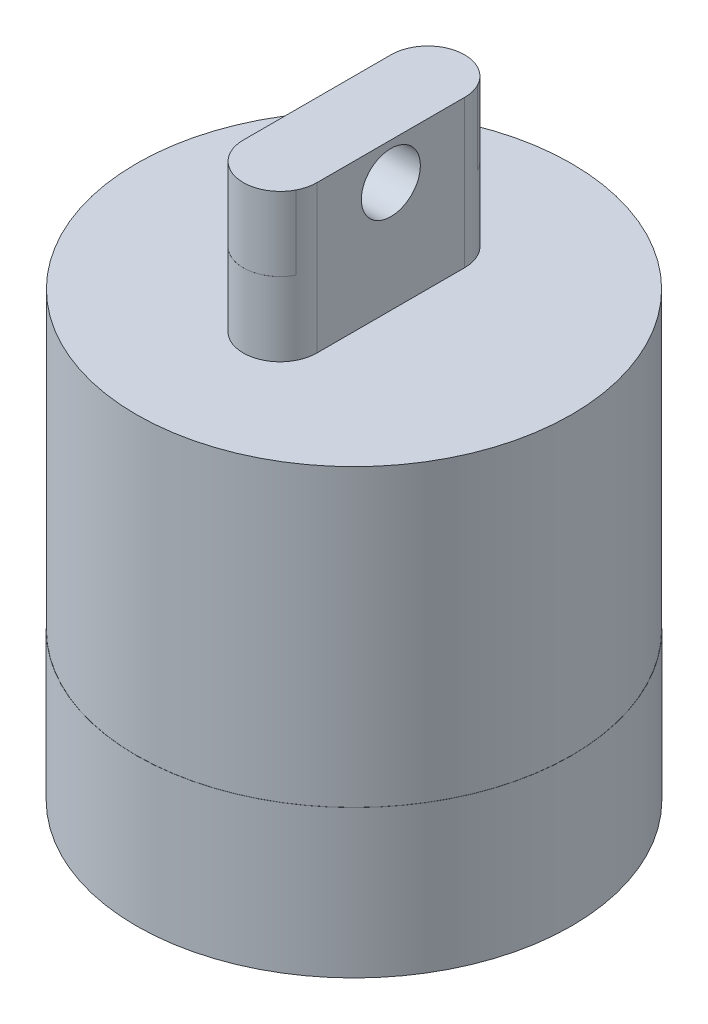
ISO-10303-21;
HEADER;
FILE_DESCRIPTION(('STEP AP214'),'2;1');
FILE_NAME('part.step','',(''),(''),'','','');
FILE_SCHEMA(('AUTOMOTIVE_DESIGN { 1 0 10303 214 1 1 1 1 }'));
ENDSEC;
DATA;
#1=APPLICATION_CONTEXT('core data for automotive mechanical design processes');
#2=APPLICATION_PROTOCOL_DEFINITION('international standard','automotive_design',2000,#1);
#3=PRODUCT_CONTEXT('',#1,'mechanical');
#4=PRODUCT('Part','Part','',(#3));
#5=PRODUCT_RELATED_PRODUCT_CATEGORY('part','',(#4));
#6=PRODUCT_DEFINITION_FORMATION('','',#4);
#7=PRODUCT_DEFINITION_CONTEXT('part definition',#1,'design');
#8=PRODUCT_DEFINITION('design','',#6,#7);
#9=PRODUCT_DEFINITION_SHAPE('','',#8);
#10=(LENGTH_UNIT() NAMED_UNIT(*) SI_UNIT(.MILLI.,.METRE.));
#11=(NAMED_UNIT(*) PLANE_ANGLE_UNIT() SI_UNIT($,.RADIAN.));
#12=(NAMED_UNIT(*) SI_UNIT($,.STERADIAN.) SOLID_ANGLE_UNIT());
#13=UNCERTAINTY_MEASURE_WITH_UNIT(LENGTH_MEASURE(1.E-05),#10,'distance_accuracy_value','');
#14=(GEOMETRIC_REPRESENTATION_CONTEXT(3) GLOBAL_UNCERTAINTY_ASSIGNED_CONTEXT((#13)) GLOBAL_UNIT_ASSIGNED_CONTEXT((#10,
#11,#12)) REPRESENTATION_CONTEXT('',''));
#15=CARTESIAN_POINT('',(0.,0.,0.));
#16=DIRECTION('',(0.,0.,1.));
#17=DIRECTION('',(1.,0.,0.));
#18=AXIS2_PLACEMENT_3D('',#15,#16,#17);
#19=CARTESIAN_POINT('',(0.,76.2,0.));
#20=DIRECTION('',(0.,-1.,0.));
#21=DIRECTION('',(0.,0.,-1.));
#22=AXIS2_PLACEMENT_3D('',#19,#20,#21);
#23=CYLINDRICAL_SURFACE('',#22,37.4396440225819);
#24=CARTESIAN_POINT('',(0.,0.,0.));
#25=DIRECTION('',(0.,1.,0.));
#26=DIRECTION('',(0.,0.,1.));
#27=AXIS2_PLACEMENT_3D('',#24,#25,#26);
#28=CIRCLE('',#27,37.4396440225819);
#29=CARTESIAN_POINT('',(0.,0.,37.4396440225819));
#30=VERTEX_POINT('',#29);
#31=EDGE_CURVE('E182',#30,#30,#28,.F.);
#32=ORIENTED_EDGE('',*,*,#31,.F.);
#33=EDGE_LOOP('',(#32));
#34=FACE_BOUND('',#33,.T.);
#35=CARTESIAN_POINT('',(0.,50.8,0.));
#36=DIRECTION('',(0.,1.,0.));
#37=DIRECTION('',(0.,0.,1.));
#38=AXIS2_PLACEMENT_3D('',#35,#36,#37);
#39=CIRCLE('',#38,37.4396440225819);
#40=CARTESIAN_POINT('',(0.,50.8,37.4396440225819));
#41=VERTEX_POINT('',#40);
#42=EDGE_CURVE('E157',#41,#41,#39,.T.);
#43=ORIENTED_EDGE('',*,*,#42,.F.);
#44=EDGE_LOOP('',(#43));
#45=FACE_BOUND('',#44,.T.);
#46=ADVANCED_FACE('F39',(#34,#45),#23,.T.);
#47=CARTESIAN_POINT('',(0.,50.8,12.7181992153051));
#48=DIRECTION('',(0.,1.,0.));
#49=DIRECTION('',(0.,0.,1.));
#50=AXIS2_PLACEMENT_3D('',#47,#48,#49);
#51=CYLINDRICAL_SURFACE('',#50,6.34167741694654);
#52=DIRECTION('',(0.,1.,0.));
#53=VECTOR('',#52,1.);
#54=CARTESIAN_POINT('',(-5.64341315538932,63.5,15.6110802045939));
#55=LINE('',#54,#53);
#56=CARTESIAN_POINT('',(-5.64341315538932,63.5,15.6110802045939));
#57=VERTEX_POINT('',#56);
#58=CARTESIAN_POINT('',(-5.64341315538932,76.2,15.6110802045939));
#59=VERTEX_POINT('',#58);
#60=EDGE_CURVE('E179',#57,#59,#55,.T.);
#61=ORIENTED_EDGE('',*,*,#60,.T.);
#62=CARTESIAN_POINT('',(0.,76.2,12.7181992153051));
#63=DIRECTION('',(0.,1.,0.));
#64=DIRECTION('',(0.,0.,1.));
#65=AXIS2_PLACEMENT_3D('',#62,#63,#64);
#66=CIRCLE('',#65,6.34167741694654);
#67=CARTESIAN_POINT('',(-6.34167741694654,76.2,12.7181992153051));
#68=VERTEX_POINT('',#67);
#69=EDGE_CURVE('E146',#68,#59,#66,.T.);
#70=ORIENTED_EDGE('',*,*,#69,.F.);
#71=DIRECTION('',(0.,1.,0.));
#72=VECTOR('',#71,1.);
#73=CARTESIAN_POINT('',(-6.34167741694654,50.8,12.7181992153051));
#74=LINE('',#73,#72);
#75=CARTESIAN_POINT('',(-6.34167741694654,50.8,12.7181992153051));
#76=VERTEX_POINT('',#75);
#77=EDGE_CURVE('E131',#76,#68,#74,.T.);
#78=ORIENTED_EDGE('',*,*,#77,.F.);
#79=CARTESIAN_POINT('',(0.,50.8,12.7181992153051));
#80=DIRECTION('',(0.,1.,0.));
#81=DIRECTION('',(0.,0.,1.));
#82=AXIS2_PLACEMENT_3D('',#79,#80,#81);
#83=CIRCLE('',#82,6.34167741694654);
#84=CARTESIAN_POINT('',(6.34167741694654,50.8,12.7181992153051));
#85=VERTEX_POINT('',#84);
#86=EDGE_CURVE('E123',#76,#85,#83,.T.);
#87=ORIENTED_EDGE('',*,*,#86,.T.);
#88=DIRECTION('',(0.,1.,0.));
#89=VECTOR('',#88,1.);
#90=CARTESIAN_POINT('',(6.34167741694654,50.8,12.7181992153051));
#91=LINE('',#90,#89);
#92=CARTESIAN_POINT('',(6.34167741694654,76.2,12.7181992153051));
#93=VERTEX_POINT('',#92);
#94=EDGE_CURVE('E106',#85,#93,#91,.T.);
#95=ORIENTED_EDGE('',*,*,#94,.T.);
#96=CARTESIAN_POINT('',(0.,76.2,12.7181992153051));
#97=DIRECTION('',(0.,1.,0.));
#98=DIRECTION('',(0.,0.,1.));
#99=AXIS2_PLACEMENT_3D('',#96,#97,#98);
#100=CIRCLE('',#99,6.34167741694654);
#101=CARTESIAN_POINT('',(5.64341315538739,76.2,15.6110802045977));
#102=VERTEX_POINT('',#101);
#103=EDGE_CURVE('E43',#102,#93,#100,.T.);
#104=ORIENTED_EDGE('',*,*,#103,.F.);
#105=DIRECTION('',(0.,1.,0.));
#106=VECTOR('',#105,1.);
#107=CARTESIAN_POINT('',(5.64341315538739,63.5,15.6110802045977));
#108=LINE('',#107,#106);
#109=CARTESIAN_POINT('',(5.64341315538739,63.5,15.6110802045977));
#110=VERTEX_POINT('',#109);
#111=EDGE_CURVE('E174',#102,#110,#108,.F.);
#112=ORIENTED_EDGE('',*,*,#111,.T.);
#113=CARTESIAN_POINT('',(0.,63.5,12.7181992153051));
#114=DIRECTION('',(0.,1.,0.));
#115=DIRECTION('',(0.,0.,1.));
#116=AXIS2_PLACEMENT_3D('',#113,#114,#115);
#117=CIRCLE('',#116,6.34167741694654);
#118=EDGE_CURVE('E63',#57,#110,#117,.T.);
#119=ORIENTED_EDGE('',*,*,#118,.F.);
#120=EDGE_LOOP('',(#61,#70,#78,#87,#95,#104,#112,#119));
#121=FACE_BOUND('',#120,.T.);
#122=ADVANCED_FACE('F129',(#121),#51,.T.);
#123=CARTESIAN_POINT('',(0.,50.8,-12.7181992153051));
#124=DIRECTION('',(0.,1.,0.));
#125=DIRECTION('',(0.,0.,1.));
#126=AXIS2_PLACEMENT_3D('',#123,#124,#125);
#127=CYLINDRICAL_SURFACE('',#126,6.34167741694654);
#128=DIRECTION('',(0.,1.,0.));
#129=VECTOR('',#128,1.);
#130=CARTESIAN_POINT('',(5.64341315538851,63.5,-15.6110802045955));
#131=LINE('',#130,#129);
#132=CARTESIAN_POINT('',(5.64341315538851,63.5,-15.6110802045955));
#133=VERTEX_POINT('',#132);
#134=CARTESIAN_POINT('',(5.64341315538851,76.2,-15.6110802045955));
#135=VERTEX_POINT('',#134);
#136=EDGE_CURVE('E171',#133,#135,#131,.T.);
#137=ORIENTED_EDGE('',*,*,#136,.T.);
#138=CARTESIAN_POINT('',(0.,76.2,-12.7181992153051));
#139=DIRECTION('',(0.,1.,0.));
#140=DIRECTION('',(0.,0.,1.));
#141=AXIS2_PLACEMENT_3D('',#138,#139,#140);
#142=CIRCLE('',#141,6.34167741694654);
#143=CARTESIAN_POINT('',(6.34167741694654,76.2,-12.7181992153051));
#144=VERTEX_POINT('',#143);
#145=EDGE_CURVE('E55',#144,#135,#142,.T.);
#146=ORIENTED_EDGE('',*,*,#145,.F.);
#147=DIRECTION('',(0.,1.,0.));
#148=VECTOR('',#147,1.);
#149=CARTESIAN_POINT('',(6.34167741694654,50.8,-12.7181992153051));
#150=LINE('',#149,#148);
#151=CARTESIAN_POINT('',(6.34167741694654,50.8,-12.7181992153051));
#152=VERTEX_POINT('',#151);
#153=EDGE_CURVE('E115',#152,#144,#150,.T.);
#154=ORIENTED_EDGE('',*,*,#153,.F.);
#155=CARTESIAN_POINT('',(0.,50.8,-12.7181992153051));
#156=DIRECTION('',(0.,1.,0.));
#157=DIRECTION('',(0.,0.,1.));
#158=AXIS2_PLACEMENT_3D('',#155,#156,#157);
#159=CIRCLE('',#158,6.34167741694654);
#160=CARTESIAN_POINT('',(-6.34167741694654,50.8,-12.7181992153051));
#161=VERTEX_POINT('',#160);
#162=EDGE_CURVE('E126',#152,#161,#159,.T.);
#163=ORIENTED_EDGE('',*,*,#162,.T.);
#164=DIRECTION('',(0.,1.,0.));
#165=VECTOR('',#164,1.);
#166=CARTESIAN_POINT('',(-6.34167741694654,50.8,-12.7181992153051));
#167=LINE('',#166,#165);
#168=CARTESIAN_POINT('',(-6.34167741694654,76.2,-12.7181992153051));
#169=VERTEX_POINT('',#168);
#170=EDGE_CURVE('E158',#161,#169,#167,.T.);
#171=ORIENTED_EDGE('',*,*,#170,.T.);
#172=CARTESIAN_POINT('',(0.,76.2,-12.7181992153051));
#173=DIRECTION('',(0.,1.,0.));
#174=DIRECTION('',(0.,0.,1.));
#175=AXIS2_PLACEMENT_3D('',#172,#173,#174);
#176=CIRCLE('',#175,6.34167741694654);
#177=CARTESIAN_POINT('',(-5.64341315538945,76.2,-15.6110802045937));
#178=VERTEX_POINT('',#177);
#179=EDGE_CURVE('E11',#178,#169,#176,.T.);
#180=ORIENTED_EDGE('',*,*,#179,.F.);
#181=DIRECTION('',(0.,1.,0.));
#182=VECTOR('',#181,1.);
#183=CARTESIAN_POINT('',(-5.64341315538945,63.5,-15.6110802045937));
#184=LINE('',#183,#182);
#185=CARTESIAN_POINT('',(-5.64341315538945,63.5,-15.6110802045937));
#186=VERTEX_POINT('',#185);
#187=EDGE_CURVE('E163',#178,#186,#184,.F.);
#188=ORIENTED_EDGE('',*,*,#187,.T.);
#189=CARTESIAN_POINT('',(0.,63.5,-12.7181992153051));
#190=DIRECTION('',(0.,1.,0.));
#191=DIRECTION('',(0.,0.,1.));
#192=AXIS2_PLACEMENT_3D('',#189,#190,#191);
#193=CIRCLE('',#192,6.34167741694654);
#194=EDGE_CURVE('E166',#133,#186,#193,.T.);
#195=ORIENTED_EDGE('',*,*,#194,.F.);
#196=EDGE_LOOP('',(#137,#146,#154,#163,#171,#180,#188,#195));
#197=FACE_BOUND('',#196,.T.);
#198=ADVANCED_FACE('F224',(#197),#127,.T.);
#199=CARTESIAN_POINT('',(0.,50.8,0.));
#200=DIRECTION('',(0.,1.,0.));
#201=DIRECTION('',(0.,0.,1.));
#202=AXIS2_PLACEMENT_3D('',#199,#200,#201);
#203=PLANE('',#202);
#204=DIRECTION('',(0.,0.,1.));
#205=VECTOR('',#204,1.);
#206=CARTESIAN_POINT('',(-6.34167741694654,50.8,12.7181992153051));
#207=LINE('',#206,#205);
#208=EDGE_CURVE('E116',#161,#76,#207,.T.);
#209=ORIENTED_EDGE('',*,*,#208,.F.);
#210=ORIENTED_EDGE('',*,*,#162,.F.);
#211=DIRECTION('',(0.,0.,-1.));
#212=VECTOR('',#211,1.);
#213=CARTESIAN_POINT('',(6.34167741694654,50.8,12.7181992153051));
#214=LINE('',#213,#212);
#215=EDGE_CURVE('E109',#85,#152,#214,.T.);
#216=ORIENTED_EDGE('',*,*,#215,.F.);
#217=ORIENTED_EDGE('',*,*,#86,.F.);
#218=EDGE_LOOP('',(#209,#210,#216,#217));
#219=FACE_BOUND('',#218,.T.);
#220=ORIENTED_EDGE('',*,*,#42,.T.);
#221=EDGE_LOOP('',(#220));
#222=FACE_BOUND('',#221,.T.);
#223=ADVANCED_FACE('F121',(#219,#222),#203,.T.);
#224=CARTESIAN_POINT('',(-6.34167741694654,50.8,12.7181992153051));
#225=DIRECTION('',(-1.,0.,0.));
#226=DIRECTION('',(0.,0.,1.));
#227=AXIS2_PLACEMENT_3D('',#224,#225,#226);
#228=PLANE('',#227);
#229=CARTESIAN_POINT('',(-6.34167741694654,69.85,0.));
#230=DIRECTION('',(-1.,0.,0.));
#231=DIRECTION('',(0.,0.,1.));
#232=AXIS2_PLACEMENT_3D('',#229,#230,#231);
#233=CIRCLE('',#232,5.08);
#234=CARTESIAN_POINT('',(-6.34167741694654,69.85,5.08));
#235=VERTEX_POINT('',#234);
#236=EDGE_CURVE('E167',#235,#235,#233,.T.);
#237=ORIENTED_EDGE('',*,*,#236,.F.);
#238=EDGE_LOOP('',(#237));
#239=FACE_BOUND('',#238,.T.);
#240=DIRECTION('',(0.,0.,1.));
#241=VECTOR('',#240,1.);
#242=CARTESIAN_POINT('',(-6.34167741694654,76.2,12.7181992153051));
#243=LINE('',#242,#241);
#244=EDGE_CURVE('E133',#169,#68,#243,.T.);
#245=ORIENTED_EDGE('',*,*,#244,.F.);
#246=ORIENTED_EDGE('',*,*,#170,.F.);
#247=ORIENTED_EDGE('',*,*,#208,.T.);
#248=ORIENTED_EDGE('',*,*,#77,.T.);
#249=EDGE_LOOP('',(#245,#246,#247,#248));
#250=FACE_BOUND('',#249,.T.);
#251=ADVANCED_FACE('F215',(#239,#250),#228,.T.);
#252=CARTESIAN_POINT('',(6.34167741694654,50.8,12.7181992153051));
#253=DIRECTION('',(1.,0.,0.));
#254=DIRECTION('',(0.,0.,-1.));
#255=AXIS2_PLACEMENT_3D('',#252,#253,#254);
#256=PLANE('',#255);
#257=CARTESIAN_POINT('',(6.34167741694654,69.85,0.));
#258=DIRECTION('',(1.,0.,0.));
#259=DIRECTION('',(0.,0.,-1.));
#260=AXIS2_PLACEMENT_3D('',#257,#258,#259);
#261=CIRCLE('',#260,5.08);
#262=CARTESIAN_POINT('',(6.34167741694654,69.85,-5.08));
#263=VERTEX_POINT('',#262);
#264=EDGE_CURVE('E205',#263,#263,#261,.T.);
#265=ORIENTED_EDGE('',*,*,#264,.F.);
#266=EDGE_LOOP('',(#265));
#267=FACE_BOUND('',#266,.T.);
#268=DIRECTION('',(0.,0.,-1.));
#269=VECTOR('',#268,1.);
#270=CARTESIAN_POINT('',(6.34167741694654,76.2,12.7181992153051));
#271=LINE('',#270,#269);
#272=EDGE_CURVE('E111',#93,#144,#271,.T.);
#273=ORIENTED_EDGE('',*,*,#272,.F.);
#274=ORIENTED_EDGE('',*,*,#94,.F.);
#275=ORIENTED_EDGE('',*,*,#215,.T.);
#276=ORIENTED_EDGE('',*,*,#153,.T.);
#277=EDGE_LOOP('',(#273,#274,#275,#276));
#278=FACE_BOUND('',#277,.T.);
#279=ADVANCED_FACE('F108',(#267,#278),#256,.T.);
#280=CARTESIAN_POINT('',(76.2,69.85,0.));
#281=DIRECTION('',(-1.,0.,0.));
#282=DIRECTION('',(0.,0.,1.));
#283=AXIS2_PLACEMENT_3D('',#280,#281,#282);
#284=CYLINDRICAL_SURFACE('',#283,5.08);
#285=ORIENTED_EDGE('',*,*,#264,.T.);
#286=EDGE_LOOP('',(#285));
#287=FACE_BOUND('',#286,.T.);
#288=ORIENTED_EDGE('',*,*,#236,.T.);
#289=EDGE_LOOP('',(#288));
#290=FACE_BOUND('',#289,.T.);
#291=ADVANCED_FACE('F213',(#287,#290),#284,.F.);
#292=CARTESIAN_POINT('',(0.,63.5,0.));
#293=DIRECTION('',(0.,1.,0.));
#294=DIRECTION('',(0.,0.,1.));
#295=AXIS2_PLACEMENT_3D('',#292,#293,#294);
#296=PLANE('',#295);
#297=CARTESIAN_POINT('',(0.,63.5,12.7));
#298=DIRECTION('',(0.,1.,0.));
#299=DIRECTION('',(0.,0.,1.));
#300=AXIS2_PLACEMENT_3D('',#297,#298,#299);
#301=CIRCLE('',#300,6.35);
#302=EDGE_CURVE('E195',#110,#57,#301,.F.);
#303=ORIENTED_EDGE('',*,*,#302,.T.);
#304=ORIENTED_EDGE('',*,*,#118,.T.);
#305=EDGE_LOOP('',(#303,#304));
#306=FACE_BOUND('',#305,.T.);
#307=ADVANCED_FACE('F41',(#306),#296,.T.);
#308=CARTESIAN_POINT('',(0.,63.5,-12.7));
#309=DIRECTION('',(0.,1.,0.));
#310=DIRECTION('',(0.,0.,1.));
#311=AXIS2_PLACEMENT_3D('',#308,#309,#310);
#312=CIRCLE('',#311,6.35);
#313=EDGE_CURVE('E191',#186,#133,#312,.F.);
#314=ORIENTED_EDGE('',*,*,#313,.T.);
#315=ORIENTED_EDGE('',*,*,#194,.T.);
#316=EDGE_LOOP('',(#314,#315));
#317=FACE_BOUND('',#316,.T.);
#318=ADVANCED_FACE('F230',(#317),#296,.T.);
#319=CARTESIAN_POINT('',(0.,76.2,12.7));
#320=DIRECTION('',(0.,-1.,0.));
#321=DIRECTION('',(0.,0.,-1.));
#322=AXIS2_PLACEMENT_3D('',#319,#320,#321);
#323=CYLINDRICAL_SURFACE('',#322,6.35);
#324=ORIENTED_EDGE('',*,*,#60,.F.);
#325=ORIENTED_EDGE('',*,*,#302,.F.);
#326=ORIENTED_EDGE('',*,*,#111,.F.);
#327=CARTESIAN_POINT('',(0.,76.2,12.7));
#328=DIRECTION('',(0.,1.,0.));
#329=DIRECTION('',(0.,0.,1.));
#330=AXIS2_PLACEMENT_3D('',#327,#328,#329);
#331=CIRCLE('',#330,6.35);
#332=EDGE_CURVE('E183',#59,#102,#331,.T.);
#333=ORIENTED_EDGE('',*,*,#332,.F.);
#334=EDGE_LOOP('',(#324,#325,#326,#333));
#335=FACE_BOUND('',#334,.T.);
#336=ADVANCED_FACE('F236',(#335),#323,.T.);
#337=CARTESIAN_POINT('',(0.,76.2,-12.7));
#338=DIRECTION('',(0.,-1.,0.));
#339=DIRECTION('',(0.,0.,-1.));
#340=AXIS2_PLACEMENT_3D('',#337,#338,#339);
#341=CYLINDRICAL_SURFACE('',#340,6.35);
#342=ORIENTED_EDGE('',*,*,#136,.F.);
#343=ORIENTED_EDGE('',*,*,#313,.F.);
#344=ORIENTED_EDGE('',*,*,#187,.F.);
#345=CARTESIAN_POINT('',(0.,76.2,-12.7));
#346=DIRECTION('',(0.,1.,0.));
#347=DIRECTION('',(0.,0.,1.));
#348=AXIS2_PLACEMENT_3D('',#345,#346,#347);
#349=CIRCLE('',#348,6.35);
#350=EDGE_CURVE('E187',#135,#178,#349,.T.);
#351=ORIENTED_EDGE('',*,*,#350,.F.);
#352=EDGE_LOOP('',(#342,#343,#344,#351));
#353=FACE_BOUND('',#352,.T.);
#354=ADVANCED_FACE('F228',(#353),#341,.T.);
#355=CARTESIAN_POINT('',(0.,76.2,12.7));
#356=DIRECTION('',(0.,1.,0.));
#357=DIRECTION('',(0.,0.,1.));
#358=AXIS2_PLACEMENT_3D('',#355,#356,#357);
#359=PLANE('',#358);
#360=ORIENTED_EDGE('',*,*,#244,.T.);
#361=ORIENTED_EDGE('',*,*,#69,.T.);
#362=ORIENTED_EDGE('',*,*,#332,.T.);
#363=ORIENTED_EDGE('',*,*,#103,.T.);
#364=ORIENTED_EDGE('',*,*,#272,.T.);
#365=ORIENTED_EDGE('',*,*,#145,.T.);
#366=ORIENTED_EDGE('',*,*,#350,.T.);
#367=ORIENTED_EDGE('',*,*,#179,.T.);
#368=EDGE_LOOP('',(#360,#361,#362,#363,#364,#365,#366,#367));
#369=FACE_BOUND('',#368,.T.);
#370=ADVANCED_FACE('F221',(#369),#359,.T.);
#371=CARTESIAN_POINT('',(0.,-25.4,0.));
#372=DIRECTION('',(0.,1.,0.));
#373=DIRECTION('',(0.,0.,1.));
#374=AXIS2_PLACEMENT_3D('',#371,#372,#373);
#375=CYLINDRICAL_SURFACE('',#374,37.465);
#376=CARTESIAN_POINT('',(0.,-25.4,0.));
#377=DIRECTION('',(0.,-1.,0.));
#378=DIRECTION('',(0.,0.,-1.));
#379=AXIS2_PLACEMENT_3D('',#376,#377,#378);
#380=CIRCLE('',#379,37.465);
#381=CARTESIAN_POINT('',(0.,-25.4,-37.465));
#382=VERTEX_POINT('',#381);
#383=EDGE_CURVE('E150',#382,#382,#380,.T.);
#384=ORIENTED_EDGE('',*,*,#383,.F.);
#385=EDGE_LOOP('',(#384));
#386=FACE_BOUND('',#385,.T.);
#387=CARTESIAN_POINT('',(0.,0.,0.));
#388=DIRECTION('',(0.,-1.,0.));
#389=DIRECTION('',(0.,0.,-1.));
#390=AXIS2_PLACEMENT_3D('',#387,#388,#389);
#391=CIRCLE('',#390,37.465);
#392=CARTESIAN_POINT('',(0.,0.,-37.465));
#393=VERTEX_POINT('',#392);
#394=EDGE_CURVE('E139',#393,#393,#391,.T.);
#395=ORIENTED_EDGE('',*,*,#394,.T.);
#396=EDGE_LOOP('',(#395));
#397=FACE_BOUND('',#396,.T.);
#398=ADVANCED_FACE('F258',(#386,#397),#375,.T.);
#399=CARTESIAN_POINT('',(0.,-25.4,0.));
#400=DIRECTION('',(0.,-1.,0.));
#401=DIRECTION('',(0.,0.,-1.));
#402=AXIS2_PLACEMENT_3D('',#399,#400,#401);
#403=PLANE('',#402);
#404=ORIENTED_EDGE('',*,*,#383,.T.);
#405=EDGE_LOOP('',(#404));
#406=FACE_BOUND('',#405,.T.);
#407=ADVANCED_FACE('F281',(#406),#403,.T.);
#408=CARTESIAN_POINT('',(0.,0.,0.));
#409=DIRECTION('',(0.,-1.,0.));
#410=DIRECTION('',(0.,0.,-1.));
#411=AXIS2_PLACEMENT_3D('',#408,#409,#410);
#412=PLANE('',#411);
#413=ORIENTED_EDGE('',*,*,#31,.T.);
#414=EDGE_LOOP('',(#413));
#415=FACE_BOUND('',#414,.T.);
#416=ORIENTED_EDGE('',*,*,#394,.F.);
#417=EDGE_LOOP('',(#416));
#418=FACE_BOUND('',#417,.T.);
#419=ADVANCED_FACE('F293',(#415,#418),#412,.F.);
#420=CLOSED_SHELL('',(#46,#122,#198,#223,#251,#279,#291,#307,#318,#336,#354,#370,#398,#407,#419));
#421=MANIFOLD_SOLID_BREP('B2',#420);
#422=ADVANCED_BREP_SHAPE_REPRESENTATION('',(#18,#421),#14);
#423=SHAPE_DEFINITION_REPRESENTATION(#9,#422);
ENDSEC;
END-ISO-10303-21;
